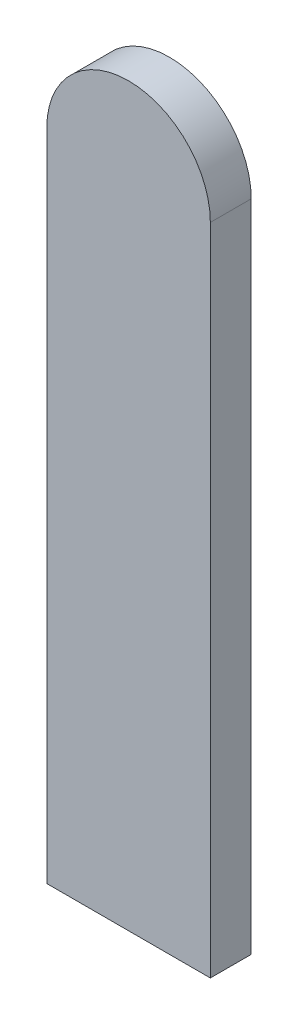
ISO-10303-21;
HEADER;
FILE_DESCRIPTION(('STEP AP214'),'2;1');
FILE_NAME('part.step','',(''),(''),'','','');
FILE_SCHEMA(('AUTOMOTIVE_DESIGN { 1 0 10303 214 1 1 1 1 }'));
ENDSEC;
DATA;
#1=APPLICATION_CONTEXT('core data for automotive mechanical design processes');
#2=APPLICATION_PROTOCOL_DEFINITION('international standard','automotive_design',2000,#1);
#3=PRODUCT_CONTEXT('',#1,'mechanical');
#4=PRODUCT('Part','Part','',(#3));
#5=PRODUCT_RELATED_PRODUCT_CATEGORY('part','',(#4));
#6=PRODUCT_DEFINITION_FORMATION('','',#4);
#7=PRODUCT_DEFINITION_CONTEXT('part definition',#1,'design');
#8=PRODUCT_DEFINITION('design','',#6,#7);
#9=PRODUCT_DEFINITION_SHAPE('','',#8);
#10=(LENGTH_UNIT() NAMED_UNIT(*) SI_UNIT(.MILLI.,.METRE.));
#11=(NAMED_UNIT(*) PLANE_ANGLE_UNIT() SI_UNIT($,.RADIAN.));
#12=(NAMED_UNIT(*) SI_UNIT($,.STERADIAN.) SOLID_ANGLE_UNIT());
#13=UNCERTAINTY_MEASURE_WITH_UNIT(LENGTH_MEASURE(1.E-05),#10,'distance_accuracy_value','');
#14=(GEOMETRIC_REPRESENTATION_CONTEXT(3) GLOBAL_UNCERTAINTY_ASSIGNED_CONTEXT((#13)) GLOBAL_UNIT_ASSIGNED_CONTEXT((#10,
#11,#12)) REPRESENTATION_CONTEXT('',''));
#15=CARTESIAN_POINT('',(0.,0.,0.));
#16=DIRECTION('',(0.,0.,1.));
#17=DIRECTION('',(1.,0.,0.));
#18=AXIS2_PLACEMENT_3D('',#15,#16,#17);
#19=CARTESIAN_POINT('',(0.,0.,1.));
#20=DIRECTION('',(-1.,0.,0.));
#21=DIRECTION('',(0.,0.,1.));
#22=AXIS2_PLACEMENT_3D('',#19,#20,#21);
#23=PLANE('',#22);
#24=DIRECTION('',(0.,1.,0.));
#25=VECTOR('',#24,1.);
#26=CARTESIAN_POINT('',(0.,0.,0.));
#27=LINE('',#26,#25);
#28=CARTESIAN_POINT('',(0.,0.,0.));
#29=VERTEX_POINT('',#28);
#30=CARTESIAN_POINT('',(0.,16.,0.));
#31=VERTEX_POINT('',#30);
#32=EDGE_CURVE('E107',#29,#31,#27,.T.);
#33=ORIENTED_EDGE('',*,*,#32,.T.);
#34=DIRECTION('',(0.,0.,-1.));
#35=VECTOR('',#34,1.);
#36=CARTESIAN_POINT('',(0.,16.,1.));
#37=LINE('',#36,#35);
#38=CARTESIAN_POINT('',(0.,16.,1.));
#39=VERTEX_POINT('',#38);
#40=EDGE_CURVE('E11',#39,#31,#37,.T.);
#41=ORIENTED_EDGE('',*,*,#40,.F.);
#42=DIRECTION('',(0.,1.,0.));
#43=VECTOR('',#42,1.);
#44=CARTESIAN_POINT('',(0.,0.,1.));
#45=LINE('',#44,#43);
#46=CARTESIAN_POINT('',(0.,0.,1.));
#47=VERTEX_POINT('',#46);
#48=EDGE_CURVE('E91',#47,#39,#45,.T.);
#49=ORIENTED_EDGE('',*,*,#48,.F.);
#50=DIRECTION('',(0.,0.,-1.));
#51=VECTOR('',#50,1.);
#52=CARTESIAN_POINT('',(0.,0.,1.));
#53=LINE('',#52,#51);
#54=EDGE_CURVE('E103',#47,#29,#53,.T.);
#55=ORIENTED_EDGE('',*,*,#54,.T.);
#56=EDGE_LOOP('',(#33,#41,#49,#55));
#57=FACE_BOUND('',#56,.T.);
#58=ADVANCED_FACE('F39',(#57),#23,.F.);
#59=CARTESIAN_POINT('',(-2.,16.,1.));
#60=DIRECTION('',(0.,0.,-1.));
#61=DIRECTION('',(-1.,0.,0.));
#62=AXIS2_PLACEMENT_3D('',#59,#60,#61);
#63=CYLINDRICAL_SURFACE('',#62,2.);
#64=CARTESIAN_POINT('',(-2.,16.,0.));
#65=DIRECTION('',(0.,0.,1.));
#66=DIRECTION('',(-1.,0.,0.));
#67=AXIS2_PLACEMENT_3D('',#64,#65,#66);
#68=CIRCLE('',#67,2.);
#69=CARTESIAN_POINT('',(-4.,16.,0.));
#70=VERTEX_POINT('',#69);
#71=EDGE_CURVE('E96',#31,#70,#68,.T.);
#72=ORIENTED_EDGE('',*,*,#71,.T.);
#73=DIRECTION('',(0.,0.,-1.));
#74=VECTOR('',#73,1.);
#75=CARTESIAN_POINT('',(-4.,16.,1.));
#76=LINE('',#75,#74);
#77=CARTESIAN_POINT('',(-4.,16.,1.));
#78=VERTEX_POINT('',#77);
#79=EDGE_CURVE('E48',#78,#70,#76,.T.);
#80=ORIENTED_EDGE('',*,*,#79,.F.);
#81=CARTESIAN_POINT('',(-2.,16.,1.));
#82=DIRECTION('',(0.,0.,1.));
#83=DIRECTION('',(-1.,0.,0.));
#84=AXIS2_PLACEMENT_3D('',#81,#82,#83);
#85=CIRCLE('',#84,2.);
#86=EDGE_CURVE('E86',#39,#78,#85,.T.);
#87=ORIENTED_EDGE('',*,*,#86,.F.);
#88=ORIENTED_EDGE('',*,*,#40,.T.);
#89=EDGE_LOOP('',(#72,#80,#87,#88));
#90=FACE_BOUND('',#89,.T.);
#91=ADVANCED_FACE('F95',(#90),#63,.T.);
#92=CARTESIAN_POINT('',(-4.,0.,1.));
#93=DIRECTION('',(1.,0.,0.));
#94=DIRECTION('',(0.,0.,-1.));
#95=AXIS2_PLACEMENT_3D('',#92,#93,#94);
#96=PLANE('',#95);
#97=DIRECTION('',(0.,-1.,0.));
#98=VECTOR('',#97,1.);
#99=CARTESIAN_POINT('',(-4.,0.,0.));
#100=LINE('',#99,#98);
#101=CARTESIAN_POINT('',(-4.,0.,0.));
#102=VERTEX_POINT('',#101);
#103=EDGE_CURVE('E73',#70,#102,#100,.T.);
#104=ORIENTED_EDGE('',*,*,#103,.T.);
#105=DIRECTION('',(0.,0.,-1.));
#106=VECTOR('',#105,1.);
#107=CARTESIAN_POINT('',(-4.,0.,1.));
#108=LINE('',#107,#106);
#109=CARTESIAN_POINT('',(-4.,0.,1.));
#110=VERTEX_POINT('',#109);
#111=EDGE_CURVE('E98',#110,#102,#108,.T.);
#112=ORIENTED_EDGE('',*,*,#111,.F.);
#113=DIRECTION('',(0.,-1.,0.));
#114=VECTOR('',#113,1.);
#115=CARTESIAN_POINT('',(-4.,0.,1.));
#116=LINE('',#115,#114);
#117=EDGE_CURVE('E89',#78,#110,#116,.T.);
#118=ORIENTED_EDGE('',*,*,#117,.F.);
#119=ORIENTED_EDGE('',*,*,#79,.T.);
#120=EDGE_LOOP('',(#104,#112,#118,#119));
#121=FACE_BOUND('',#120,.T.);
#122=ADVANCED_FACE('F99',(#121),#96,.F.);
#123=CARTESIAN_POINT('',(0.,0.,1.));
#124=DIRECTION('',(0.,1.,0.));
#125=DIRECTION('',(-1.,0.,0.));
#126=AXIS2_PLACEMENT_3D('',#123,#124,#125);
#127=PLANE('',#126);
#128=DIRECTION('',(1.,0.,0.));
#129=VECTOR('',#128,1.);
#130=CARTESIAN_POINT('',(0.,0.,0.));
#131=LINE('',#130,#129);
#132=EDGE_CURVE('E79',#102,#29,#131,.T.);
#133=ORIENTED_EDGE('',*,*,#132,.T.);
#134=ORIENTED_EDGE('',*,*,#54,.F.);
#135=DIRECTION('',(1.,0.,0.));
#136=VECTOR('',#135,1.);
#137=CARTESIAN_POINT('',(0.,0.,1.));
#138=LINE('',#137,#136);
#139=EDGE_CURVE('E56',#110,#47,#138,.T.);
#140=ORIENTED_EDGE('',*,*,#139,.F.);
#141=ORIENTED_EDGE('',*,*,#111,.T.);
#142=EDGE_LOOP('',(#133,#134,#140,#141));
#143=FACE_BOUND('',#142,.T.);
#144=ADVANCED_FACE('F120',(#143),#127,.F.);
#145=CARTESIAN_POINT('',(-2.,16.,1.));
#146=DIRECTION('',(0.,0.,-1.));
#147=DIRECTION('',(-1.,0.,0.));
#148=AXIS2_PLACEMENT_3D('',#145,#146,#147);
#149=PLANE('',#148);
#150=ORIENTED_EDGE('',*,*,#48,.T.);
#151=ORIENTED_EDGE('',*,*,#86,.T.);
#152=ORIENTED_EDGE('',*,*,#117,.T.);
#153=ORIENTED_EDGE('',*,*,#139,.T.);
#154=EDGE_LOOP('',(#150,#151,#152,#153));
#155=FACE_BOUND('',#154,.T.);
#156=ADVANCED_FACE('F87',(#155),#149,.F.);
#157=CARTESIAN_POINT('',(-2.,16.,0.));
#158=DIRECTION('',(0.,0.,-1.));
#159=DIRECTION('',(-1.,0.,0.));
#160=AXIS2_PLACEMENT_3D('',#157,#158,#159);
#161=PLANE('',#160);
#162=ORIENTED_EDGE('',*,*,#32,.F.);
#163=ORIENTED_EDGE('',*,*,#132,.F.);
#164=ORIENTED_EDGE('',*,*,#103,.F.);
#165=ORIENTED_EDGE('',*,*,#71,.F.);
#166=EDGE_LOOP('',(#162,#163,#164,#165));
#167=FACE_BOUND('',#166,.T.);
#168=ADVANCED_FACE('F123',(#167),#161,.T.);
#169=CLOSED_SHELL('',(#58,#91,#122,#144,#156,#168));
#170=MANIFOLD_SOLID_BREP('B2',#169);
#171=ADVANCED_BREP_SHAPE_REPRESENTATION('',(#18,#170),#14);
#172=SHAPE_DEFINITION_REPRESENTATION(#9,#171);
ENDSEC;
END-ISO-10303-21;
